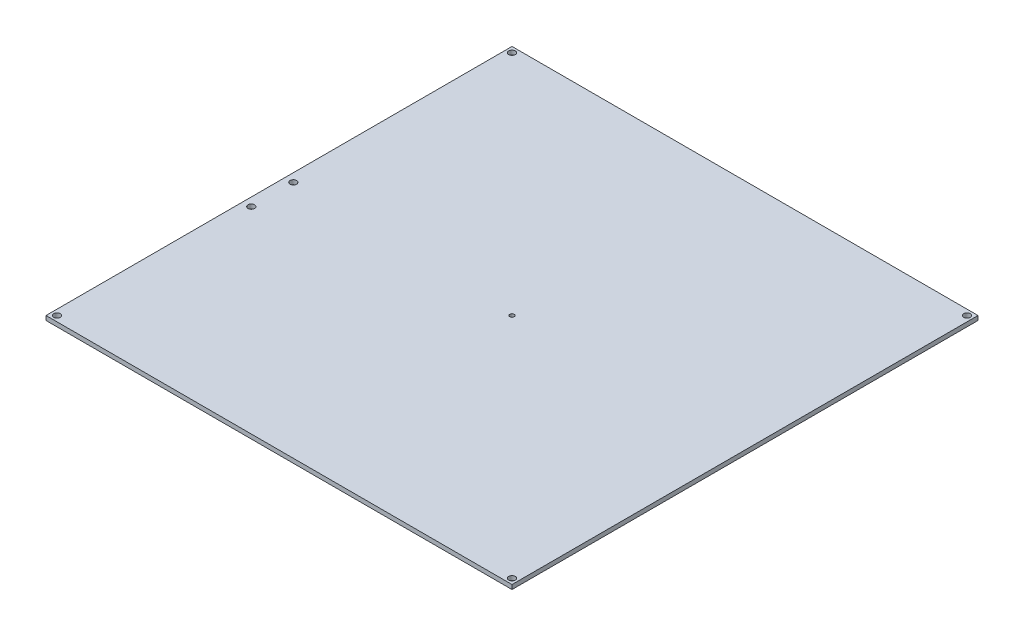
ISO-10303-21;
HEADER;
FILE_DESCRIPTION(('STEP AP214'),'2;1');
FILE_NAME('part.step','',(''),(''),'','','');
FILE_SCHEMA(('AUTOMOTIVE_DESIGN { 1 0 10303 214 1 1 1 1 }'));
ENDSEC;
DATA;
#1=APPLICATION_CONTEXT('core data for automotive mechanical design processes');
#2=APPLICATION_PROTOCOL_DEFINITION('international standard','automotive_design',2000,#1);
#3=PRODUCT_CONTEXT('',#1,'mechanical');
#4=PRODUCT('Part','Part','',(#3));
#5=PRODUCT_RELATED_PRODUCT_CATEGORY('part','',(#4));
#6=PRODUCT_DEFINITION_FORMATION('','',#4);
#7=PRODUCT_DEFINITION_CONTEXT('part definition',#1,'design');
#8=PRODUCT_DEFINITION('design','',#6,#7);
#9=PRODUCT_DEFINITION_SHAPE('','',#8);
#10=(LENGTH_UNIT() NAMED_UNIT(*) SI_UNIT(.MILLI.,.METRE.));
#11=(NAMED_UNIT(*) PLANE_ANGLE_UNIT() SI_UNIT($,.RADIAN.));
#12=(NAMED_UNIT(*) SI_UNIT($,.STERADIAN.) SOLID_ANGLE_UNIT());
#13=UNCERTAINTY_MEASURE_WITH_UNIT(LENGTH_MEASURE(1.E-05),#10,'distance_accuracy_value','');
#14=(GEOMETRIC_REPRESENTATION_CONTEXT(3) GLOBAL_UNCERTAINTY_ASSIGNED_CONTEXT((#13)) GLOBAL_UNIT_ASSIGNED_CONTEXT((#10,
#11,#12)) REPRESENTATION_CONTEXT('',''));
#15=CARTESIAN_POINT('',(0.,0.,0.));
#16=DIRECTION('',(0.,0.,1.));
#17=DIRECTION('',(1.,0.,0.));
#18=AXIS2_PLACEMENT_3D('',#15,#16,#17);
#19=CARTESIAN_POINT('',(0.,2.,0.));
#20=DIRECTION('',(0.,-1.,0.));
#21=DIRECTION('',(0.,0.,-1.));
#22=AXIS2_PLACEMENT_3D('',#19,#20,#21);
#23=PLANE('',#22);
#24=CARTESIAN_POINT('',(-103.153252948204,2.,-2.7407814972662));
#25=DIRECTION('',(0.,1.,0.));
#26=DIRECTION('',(0.,0.,1.));
#27=AXIS2_PLACEMENT_3D('',#24,#25,#26);
#28=CIRCLE('',#27,1.5);
#29=CARTESIAN_POINT('',(-103.153252948204,2.,-1.2407814972662));
#30=VERTEX_POINT('',#29);
#31=EDGE_CURVE('E154',#30,#30,#28,.T.);
#32=ORIENTED_EDGE('',*,*,#31,.F.);
#33=EDGE_LOOP('',(#32));
#34=FACE_BOUND('',#33,.T.);
#35=CARTESIAN_POINT('',(-103.153252948204,2.,16.5737407684503));
#36=DIRECTION('',(0.,1.,0.));
#37=DIRECTION('',(0.,0.,1.));
#38=AXIS2_PLACEMENT_3D('',#35,#36,#37);
#39=CIRCLE('',#38,1.5);
#40=CARTESIAN_POINT('',(-103.153252948204,2.,18.0737407684503));
#41=VERTEX_POINT('',#40);
#42=EDGE_CURVE('E148',#41,#41,#39,.T.);
#43=ORIENTED_EDGE('',*,*,#42,.F.);
#44=EDGE_LOOP('',(#43));
#45=FACE_BOUND('',#44,.T.);
#46=DIRECTION('',(0.,0.,-1.));
#47=VECTOR('',#46,1.);
#48=CARTESIAN_POINT('',(107.,2.,107.));
#49=LINE('',#48,#47);
#50=CARTESIAN_POINT('',(107.,2.,107.));
#51=VERTEX_POINT('',#50);
#52=CARTESIAN_POINT('',(107.,2.,-107.));
#53=VERTEX_POINT('',#52);
#54=EDGE_CURVE('E91',#51,#53,#49,.T.);
#55=ORIENTED_EDGE('',*,*,#54,.T.);
#56=DIRECTION('',(-1.,0.,0.));
#57=VECTOR('',#56,1.);
#58=CARTESIAN_POINT('',(-107.,2.,-107.));
#59=LINE('',#58,#57);
#60=CARTESIAN_POINT('',(-107.,2.,-107.));
#61=VERTEX_POINT('',#60);
#62=EDGE_CURVE('E86',#53,#61,#59,.T.);
#63=ORIENTED_EDGE('',*,*,#62,.T.);
#64=DIRECTION('',(0.,0.,1.));
#65=VECTOR('',#64,1.);
#66=CARTESIAN_POINT('',(-107.,2.,107.));
#67=LINE('',#66,#65);
#68=CARTESIAN_POINT('',(-107.,2.,107.));
#69=VERTEX_POINT('',#68);
#70=EDGE_CURVE('E89',#61,#69,#67,.T.);
#71=ORIENTED_EDGE('',*,*,#70,.T.);
#72=DIRECTION('',(1.,0.,0.));
#73=VECTOR('',#72,1.);
#74=CARTESIAN_POINT('',(-107.,2.,107.));
#75=LINE('',#74,#73);
#76=EDGE_CURVE('E56',#69,#51,#75,.T.);
#77=ORIENTED_EDGE('',*,*,#76,.T.);
#78=EDGE_LOOP('',(#55,#63,#71,#77));
#79=FACE_BOUND('',#78,.T.);
#80=CARTESIAN_POINT('',(-104.5,2.,-104.5));
#81=DIRECTION('',(0.,1.,0.));
#82=DIRECTION('',(0.,0.,1.));
#83=AXIS2_PLACEMENT_3D('',#80,#81,#82);
#84=CIRCLE('',#83,1.5);
#85=CARTESIAN_POINT('',(-104.5,2.,-103.));
#86=VERTEX_POINT('',#85);
#87=EDGE_CURVE('E106',#86,#86,#84,.T.);
#88=ORIENTED_EDGE('',*,*,#87,.F.);
#89=EDGE_LOOP('',(#88));
#90=FACE_BOUND('',#89,.T.);
#91=CARTESIAN_POINT('',(0.,2.,0.));
#92=DIRECTION('',(0.,1.,0.));
#93=DIRECTION('',(0.,0.,1.));
#94=AXIS2_PLACEMENT_3D('',#91,#92,#93);
#95=CIRCLE('',#94,1.);
#96=CARTESIAN_POINT('',(0.,2.,1.));
#97=VERTEX_POINT('',#96);
#98=EDGE_CURVE('E121',#97,#97,#95,.T.);
#99=ORIENTED_EDGE('',*,*,#98,.F.);
#100=EDGE_LOOP('',(#99));
#101=FACE_BOUND('',#100,.T.);
#102=CARTESIAN_POINT('',(104.5,2.,-104.500000000006));
#103=DIRECTION('',(0.,1.,0.));
#104=DIRECTION('',(0.,0.,1.));
#105=AXIS2_PLACEMENT_3D('',#102,#103,#104);
#106=CIRCLE('',#105,1.5000000000061);
#107=CARTESIAN_POINT('',(104.5,2.,-103.));
#108=VERTEX_POINT('',#107);
#109=EDGE_CURVE('E127',#108,#108,#106,.T.);
#110=ORIENTED_EDGE('',*,*,#109,.F.);
#111=EDGE_LOOP('',(#110));
#112=FACE_BOUND('',#111,.T.);
#113=CARTESIAN_POINT('',(104.500000000006,2.,104.499999999994));
#114=DIRECTION('',(0.,1.,0.));
#115=DIRECTION('',(0.,0.,1.));
#116=AXIS2_PLACEMENT_3D('',#113,#114,#115);
#117=CIRCLE('',#116,1.50000000000828);
#118=CARTESIAN_POINT('',(104.500000000006,2.,106.000000000002));
#119=VERTEX_POINT('',#118);
#120=EDGE_CURVE('E133',#119,#119,#117,.T.);
#121=ORIENTED_EDGE('',*,*,#120,.F.);
#122=EDGE_LOOP('',(#121));
#123=FACE_BOUND('',#122,.T.);
#124=CARTESIAN_POINT('',(-104.499999999994,2.,104.5));
#125=DIRECTION('',(0.,1.,0.));
#126=DIRECTION('',(0.,0.,1.));
#127=AXIS2_PLACEMENT_3D('',#124,#125,#126);
#128=CIRCLE('',#127,1.50000000000311);
#129=CARTESIAN_POINT('',(-104.499999999994,2.,106.000000000003));
#130=VERTEX_POINT('',#129);
#131=EDGE_CURVE('E139',#130,#130,#128,.T.);
#132=ORIENTED_EDGE('',*,*,#131,.F.);
#133=EDGE_LOOP('',(#132));
#134=FACE_BOUND('',#133,.T.);
#135=ADVANCED_FACE('F39',(#34,#45,#79,#90,#101,#112,#123,#134),#23,.F.);
#136=CARTESIAN_POINT('',(0.,0.,0.));
#137=DIRECTION('',(0.,-1.,0.));
#138=DIRECTION('',(0.,0.,-1.));
#139=AXIS2_PLACEMENT_3D('',#136,#137,#138);
#140=PLANE('',#139);
#141=CARTESIAN_POINT('',(-103.153252948204,0.,-2.7407814972662));
#142=DIRECTION('',(0.,1.,0.));
#143=DIRECTION('',(0.,0.,1.));
#144=AXIS2_PLACEMENT_3D('',#141,#142,#143);
#145=CIRCLE('',#144,1.5);
#146=CARTESIAN_POINT('',(-103.153252948204,0.,-1.2407814972662));
#147=VERTEX_POINT('',#146);
#148=EDGE_CURVE('E145',#147,#147,#145,.T.);
#149=ORIENTED_EDGE('',*,*,#148,.T.);
#150=EDGE_LOOP('',(#149));
#151=FACE_BOUND('',#150,.T.);
#152=CARTESIAN_POINT('',(-103.153252948204,0.,16.5737407684503));
#153=DIRECTION('',(0.,1.,0.));
#154=DIRECTION('',(0.,0.,1.));
#155=AXIS2_PLACEMENT_3D('',#152,#153,#154);
#156=CIRCLE('',#155,1.5);
#157=CARTESIAN_POINT('',(-103.153252948204,0.,18.0737407684503));
#158=VERTEX_POINT('',#157);
#159=EDGE_CURVE('E151',#158,#158,#156,.T.);
#160=ORIENTED_EDGE('',*,*,#159,.T.);
#161=EDGE_LOOP('',(#160));
#162=FACE_BOUND('',#161,.T.);
#163=CARTESIAN_POINT('',(104.500000000006,0.,104.499999999994));
#164=DIRECTION('',(0.,1.,0.));
#165=DIRECTION('',(0.,0.,1.));
#166=AXIS2_PLACEMENT_3D('',#163,#164,#165);
#167=CIRCLE('',#166,1.50000000000828);
#168=CARTESIAN_POINT('',(104.500000000006,0.,106.000000000002));
#169=VERTEX_POINT('',#168);
#170=EDGE_CURVE('E136',#169,#169,#167,.T.);
#171=ORIENTED_EDGE('',*,*,#170,.T.);
#172=EDGE_LOOP('',(#171));
#173=FACE_BOUND('',#172,.T.);
#174=CARTESIAN_POINT('',(0.,0.,0.));
#175=DIRECTION('',(0.,1.,0.));
#176=DIRECTION('',(0.,0.,1.));
#177=AXIS2_PLACEMENT_3D('',#174,#175,#176);
#178=CIRCLE('',#177,1.);
#179=CARTESIAN_POINT('',(0.,0.,1.));
#180=VERTEX_POINT('',#179);
#181=EDGE_CURVE('E124',#180,#180,#178,.T.);
#182=ORIENTED_EDGE('',*,*,#181,.T.);
#183=EDGE_LOOP('',(#182));
#184=FACE_BOUND('',#183,.T.);
#185=DIRECTION('',(0.,0.,-1.));
#186=VECTOR('',#185,1.);
#187=CARTESIAN_POINT('',(107.,0.,107.));
#188=LINE('',#187,#186);
#189=CARTESIAN_POINT('',(107.,0.,107.));
#190=VERTEX_POINT('',#189);
#191=CARTESIAN_POINT('',(107.,0.,-107.));
#192=VERTEX_POINT('',#191);
#193=EDGE_CURVE('E103',#190,#192,#188,.T.);
#194=ORIENTED_EDGE('',*,*,#193,.F.);
#195=DIRECTION('',(1.,0.,0.));
#196=VECTOR('',#195,1.);
#197=CARTESIAN_POINT('',(-107.,0.,107.));
#198=LINE('',#197,#196);
#199=CARTESIAN_POINT('',(-107.,0.,107.));
#200=VERTEX_POINT('',#199);
#201=EDGE_CURVE('E79',#200,#190,#198,.T.);
#202=ORIENTED_EDGE('',*,*,#201,.F.);
#203=DIRECTION('',(0.,0.,1.));
#204=VECTOR('',#203,1.);
#205=CARTESIAN_POINT('',(-107.,0.,107.));
#206=LINE('',#205,#204);
#207=CARTESIAN_POINT('',(-107.,0.,-107.));
#208=VERTEX_POINT('',#207);
#209=EDGE_CURVE('E73',#208,#200,#206,.T.);
#210=ORIENTED_EDGE('',*,*,#209,.F.);
#211=DIRECTION('',(-1.,0.,0.));
#212=VECTOR('',#211,1.);
#213=CARTESIAN_POINT('',(-107.,0.,-107.));
#214=LINE('',#213,#212);
#215=EDGE_CURVE('E95',#192,#208,#214,.T.);
#216=ORIENTED_EDGE('',*,*,#215,.F.);
#217=EDGE_LOOP('',(#194,#202,#210,#216));
#218=FACE_BOUND('',#217,.T.);
#219=CARTESIAN_POINT('',(-104.5,0.,-104.5));
#220=DIRECTION('',(0.,1.,0.));
#221=DIRECTION('',(0.,0.,1.));
#222=AXIS2_PLACEMENT_3D('',#219,#220,#221);
#223=CIRCLE('',#222,1.5);
#224=CARTESIAN_POINT('',(-104.5,0.,-103.));
#225=VERTEX_POINT('',#224);
#226=EDGE_CURVE('E118',#225,#225,#223,.T.);
#227=ORIENTED_EDGE('',*,*,#226,.T.);
#228=EDGE_LOOP('',(#227));
#229=FACE_BOUND('',#228,.T.);
#230=CARTESIAN_POINT('',(104.5,0.,-104.500000000006));
#231=DIRECTION('',(0.,1.,0.));
#232=DIRECTION('',(0.,0.,1.));
#233=AXIS2_PLACEMENT_3D('',#230,#231,#232);
#234=CIRCLE('',#233,1.5000000000061);
#235=CARTESIAN_POINT('',(104.5,0.,-103.));
#236=VERTEX_POINT('',#235);
#237=EDGE_CURVE('E130',#236,#236,#234,.T.);
#238=ORIENTED_EDGE('',*,*,#237,.T.);
#239=EDGE_LOOP('',(#238));
#240=FACE_BOUND('',#239,.T.);
#241=CARTESIAN_POINT('',(-104.499999999994,0.,104.5));
#242=DIRECTION('',(0.,1.,0.));
#243=DIRECTION('',(0.,0.,1.));
#244=AXIS2_PLACEMENT_3D('',#241,#242,#243);
#245=CIRCLE('',#244,1.50000000000311);
#246=CARTESIAN_POINT('',(-104.499999999994,0.,106.000000000003));
#247=VERTEX_POINT('',#246);
#248=EDGE_CURVE('E142',#247,#247,#245,.T.);
#249=ORIENTED_EDGE('',*,*,#248,.T.);
#250=EDGE_LOOP('',(#249));
#251=FACE_BOUND('',#250,.T.);
#252=ADVANCED_FACE('F114',(#151,#162,#173,#184,#218,#229,#240,#251),#140,.T.);
#253=CARTESIAN_POINT('',(107.,2.,107.));
#254=DIRECTION('',(-1.,0.,0.));
#255=DIRECTION('',(0.,0.,1.));
#256=AXIS2_PLACEMENT_3D('',#253,#254,#255);
#257=PLANE('',#256);
#258=ORIENTED_EDGE('',*,*,#193,.T.);
#259=DIRECTION('',(0.,-1.,0.));
#260=VECTOR('',#259,1.);
#261=CARTESIAN_POINT('',(107.,2.,-107.));
#262=LINE('',#261,#260);
#263=EDGE_CURVE('E11',#53,#192,#262,.T.);
#264=ORIENTED_EDGE('',*,*,#263,.F.);
#265=ORIENTED_EDGE('',*,*,#54,.F.);
#266=DIRECTION('',(0.,-1.,0.));
#267=VECTOR('',#266,1.);
#268=CARTESIAN_POINT('',(107.,2.,107.));
#269=LINE('',#268,#267);
#270=EDGE_CURVE('E99',#51,#190,#269,.T.);
#271=ORIENTED_EDGE('',*,*,#270,.T.);
#272=EDGE_LOOP('',(#258,#264,#265,#271));
#273=FACE_BOUND('',#272,.T.);
#274=ADVANCED_FACE('F41',(#273),#257,.F.);
#275=CARTESIAN_POINT('',(-107.,2.,-107.));
#276=DIRECTION('',(0.,0.,1.));
#277=DIRECTION('',(1.,0.,0.));
#278=AXIS2_PLACEMENT_3D('',#275,#276,#277);
#279=PLANE('',#278);
#280=ORIENTED_EDGE('',*,*,#215,.T.);
#281=DIRECTION('',(0.,-1.,0.));
#282=VECTOR('',#281,1.);
#283=CARTESIAN_POINT('',(-107.,2.,-107.));
#284=LINE('',#283,#282);
#285=EDGE_CURVE('E48',#61,#208,#284,.T.);
#286=ORIENTED_EDGE('',*,*,#285,.F.);
#287=ORIENTED_EDGE('',*,*,#62,.F.);
#288=ORIENTED_EDGE('',*,*,#263,.T.);
#289=EDGE_LOOP('',(#280,#286,#287,#288));
#290=FACE_BOUND('',#289,.T.);
#291=ADVANCED_FACE('F94',(#290),#279,.F.);
#292=CARTESIAN_POINT('',(-107.,2.,107.));
#293=DIRECTION('',(1.,0.,0.));
#294=DIRECTION('',(0.,0.,-1.));
#295=AXIS2_PLACEMENT_3D('',#292,#293,#294);
#296=PLANE('',#295);
#297=ORIENTED_EDGE('',*,*,#209,.T.);
#298=DIRECTION('',(0.,-1.,0.));
#299=VECTOR('',#298,1.);
#300=CARTESIAN_POINT('',(-107.,2.,107.));
#301=LINE('',#300,#299);
#302=EDGE_CURVE('E96',#69,#200,#301,.T.);
#303=ORIENTED_EDGE('',*,*,#302,.F.);
#304=ORIENTED_EDGE('',*,*,#70,.F.);
#305=ORIENTED_EDGE('',*,*,#285,.T.);
#306=EDGE_LOOP('',(#297,#303,#304,#305));
#307=FACE_BOUND('',#306,.T.);
#308=ADVANCED_FACE('F97',(#307),#296,.F.);
#309=CARTESIAN_POINT('',(-107.,2.,107.));
#310=DIRECTION('',(0.,0.,-1.));
#311=DIRECTION('',(-1.,0.,0.));
#312=AXIS2_PLACEMENT_3D('',#309,#310,#311);
#313=PLANE('',#312);
#314=ORIENTED_EDGE('',*,*,#201,.T.);
#315=ORIENTED_EDGE('',*,*,#270,.F.);
#316=ORIENTED_EDGE('',*,*,#76,.F.);
#317=ORIENTED_EDGE('',*,*,#302,.T.);
#318=EDGE_LOOP('',(#314,#315,#316,#317));
#319=FACE_BOUND('',#318,.T.);
#320=ADVANCED_FACE('F111',(#319),#313,.F.);
#321=CARTESIAN_POINT('',(-104.5,2.,-104.5));
#322=DIRECTION('',(0.,-1.,0.));
#323=DIRECTION('',(0.,0.,-1.));
#324=AXIS2_PLACEMENT_3D('',#321,#322,#323);
#325=CYLINDRICAL_SURFACE('',#324,1.5);
#326=ORIENTED_EDGE('',*,*,#87,.T.);
#327=EDGE_LOOP('',(#326));
#328=FACE_BOUND('',#327,.T.);
#329=ORIENTED_EDGE('',*,*,#226,.F.);
#330=EDGE_LOOP('',(#329));
#331=FACE_BOUND('',#330,.T.);
#332=ADVANCED_FACE('F196',(#328,#331),#325,.F.);
#333=CARTESIAN_POINT('',(0.,2.,0.));
#334=DIRECTION('',(0.,-1.,0.));
#335=DIRECTION('',(0.,0.,-1.));
#336=AXIS2_PLACEMENT_3D('',#333,#334,#335);
#337=CYLINDRICAL_SURFACE('',#336,1.);
#338=ORIENTED_EDGE('',*,*,#98,.T.);
#339=EDGE_LOOP('',(#338));
#340=FACE_BOUND('',#339,.T.);
#341=ORIENTED_EDGE('',*,*,#181,.F.);
#342=EDGE_LOOP('',(#341));
#343=FACE_BOUND('',#342,.T.);
#344=ADVANCED_FACE('F192',(#340,#343),#337,.F.);
#345=CARTESIAN_POINT('',(104.5,2.,-104.500000000006));
#346=DIRECTION('',(0.,-1.,0.));
#347=DIRECTION('',(0.,0.,-1.));
#348=AXIS2_PLACEMENT_3D('',#345,#346,#347);
#349=CYLINDRICAL_SURFACE('',#348,1.5000000000061);
#350=ORIENTED_EDGE('',*,*,#109,.T.);
#351=EDGE_LOOP('',(#350));
#352=FACE_BOUND('',#351,.T.);
#353=ORIENTED_EDGE('',*,*,#237,.F.);
#354=EDGE_LOOP('',(#353));
#355=FACE_BOUND('',#354,.T.);
#356=ADVANCED_FACE('F188',(#352,#355),#349,.F.);
#357=CARTESIAN_POINT('',(104.500000000006,2.,104.499999999994));
#358=DIRECTION('',(0.,-1.,0.));
#359=DIRECTION('',(0.,0.,-1.));
#360=AXIS2_PLACEMENT_3D('',#357,#358,#359);
#361=CYLINDRICAL_SURFACE('',#360,1.50000000000828);
#362=ORIENTED_EDGE('',*,*,#120,.T.);
#363=EDGE_LOOP('',(#362));
#364=FACE_BOUND('',#363,.T.);
#365=ORIENTED_EDGE('',*,*,#170,.F.);
#366=EDGE_LOOP('',(#365));
#367=FACE_BOUND('',#366,.T.);
#368=ADVANCED_FACE('F181',(#364,#367),#361,.F.);
#369=CARTESIAN_POINT('',(-104.499999999994,2.,104.5));
#370=DIRECTION('',(0.,-1.,0.));
#371=DIRECTION('',(0.,0.,-1.));
#372=AXIS2_PLACEMENT_3D('',#369,#370,#371);
#373=CYLINDRICAL_SURFACE('',#372,1.50000000000311);
#374=ORIENTED_EDGE('',*,*,#131,.T.);
#375=EDGE_LOOP('',(#374));
#376=FACE_BOUND('',#375,.T.);
#377=ORIENTED_EDGE('',*,*,#248,.F.);
#378=EDGE_LOOP('',(#377));
#379=FACE_BOUND('',#378,.T.);
#380=ADVANCED_FACE('F175',(#376,#379),#373,.F.);
#381=CARTESIAN_POINT('',(-103.153252948204,0.,16.5737407684503));
#382=DIRECTION('',(0.,1.,0.));
#383=DIRECTION('',(0.,0.,1.));
#384=AXIS2_PLACEMENT_3D('',#381,#382,#383);
#385=CYLINDRICAL_SURFACE('',#384,1.5);
#386=ORIENTED_EDGE('',*,*,#159,.F.);
#387=EDGE_LOOP('',(#386));
#388=FACE_BOUND('',#387,.T.);
#389=ORIENTED_EDGE('',*,*,#42,.T.);
#390=EDGE_LOOP('',(#389));
#391=FACE_BOUND('',#390,.T.);
#392=ADVANCED_FACE('F165',(#388,#391),#385,.F.);
#393=CARTESIAN_POINT('',(-103.153252948204,0.,-2.7407814972662));
#394=DIRECTION('',(0.,1.,0.));
#395=DIRECTION('',(0.,0.,1.));
#396=AXIS2_PLACEMENT_3D('',#393,#394,#395);
#397=CYLINDRICAL_SURFACE('',#396,1.5);
#398=ORIENTED_EDGE('',*,*,#148,.F.);
#399=EDGE_LOOP('',(#398));
#400=FACE_BOUND('',#399,.T.);
#401=ORIENTED_EDGE('',*,*,#31,.T.);
#402=EDGE_LOOP('',(#401));
#403=FACE_BOUND('',#402,.T.);
#404=ADVANCED_FACE('F162',(#400,#403),#397,.F.);
#405=CLOSED_SHELL('',(#135,#252,#274,#291,#308,#320,#332,#344,#356,#368,#380,#392,#404));
#406=MANIFOLD_SOLID_BREP('B2',#405);
#407=ADVANCED_BREP_SHAPE_REPRESENTATION('',(#18,#406),#14);
#408=SHAPE_DEFINITION_REPRESENTATION(#9,#407);
ENDSEC;
END-ISO-10303-21;
